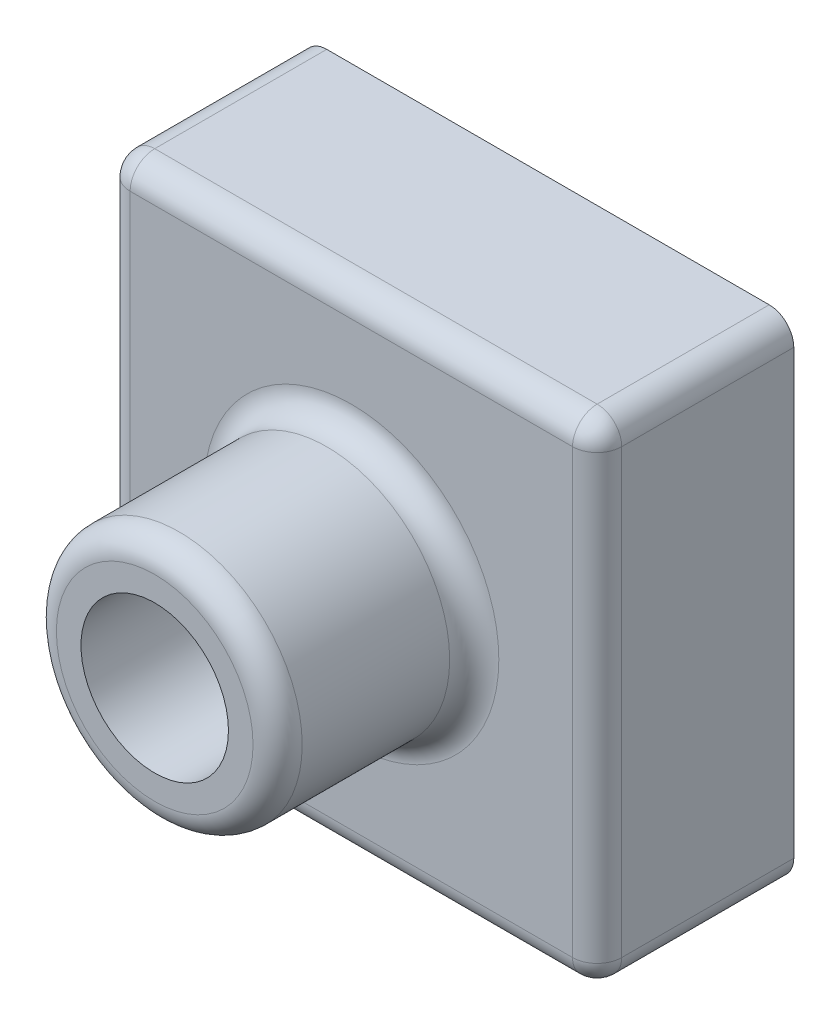
ISO-10303-21;
HEADER;
FILE_DESCRIPTION(('STEP AP214'),'2;1');
FILE_NAME('part.step','',(''),(''),'','','');
FILE_SCHEMA(('AUTOMOTIVE_DESIGN { 1 0 10303 214 1 1 1 1 }'));
ENDSEC;
DATA;
#1=APPLICATION_CONTEXT('core data for automotive mechanical design processes');
#2=APPLICATION_PROTOCOL_DEFINITION('international standard','automotive_design',2000,#1);
#3=PRODUCT_CONTEXT('',#1,'mechanical');
#4=PRODUCT('Part','Part','',(#3));
#5=PRODUCT_RELATED_PRODUCT_CATEGORY('part','',(#4));
#6=PRODUCT_DEFINITION_FORMATION('','',#4);
#7=PRODUCT_DEFINITION_CONTEXT('part definition',#1,'design');
#8=PRODUCT_DEFINITION('design','',#6,#7);
#9=PRODUCT_DEFINITION_SHAPE('','',#8);
#10=(LENGTH_UNIT() NAMED_UNIT(*) SI_UNIT(.MILLI.,.METRE.));
#11=(NAMED_UNIT(*) PLANE_ANGLE_UNIT() SI_UNIT($,.RADIAN.));
#12=(NAMED_UNIT(*) SI_UNIT($,.STERADIAN.) SOLID_ANGLE_UNIT());
#13=UNCERTAINTY_MEASURE_WITH_UNIT(LENGTH_MEASURE(1.E-05),#10,'distance_accuracy_value','');
#14=(GEOMETRIC_REPRESENTATION_CONTEXT(3) GLOBAL_UNCERTAINTY_ASSIGNED_CONTEXT((#13)) GLOBAL_UNIT_ASSIGNED_CONTEXT((#10,
#11,#12)) REPRESENTATION_CONTEXT('',''));
#15=CARTESIAN_POINT('',(0.,0.,0.));
#16=DIRECTION('',(0.,0.,1.));
#17=DIRECTION('',(1.,0.,0.));
#18=AXIS2_PLACEMENT_3D('',#15,#16,#17);
#19=CARTESIAN_POINT('',(0.,0.,40.));
#20=DIRECTION('',(0.,0.,-1.));
#21=DIRECTION('',(-1.,0.,0.));
#22=AXIS2_PLACEMENT_3D('',#19,#20,#21);
#23=PLANE('',#22);
#24=CARTESIAN_POINT('',(0.,0.,40.));
#25=DIRECTION('',(0.,0.,-1.));
#26=DIRECTION('',(-1.,0.,0.));
#27=AXIS2_PLACEMENT_3D('',#24,#25,#26);
#28=CIRCLE('',#27,30.);
#29=CARTESIAN_POINT('',(-30.,0.,40.));
#30=VERTEX_POINT('',#29);
#31=EDGE_CURVE('E145',#30,#30,#28,.T.);
#32=ORIENTED_EDGE('',*,*,#31,.T.);
#33=EDGE_LOOP('',(#32));
#34=FACE_BOUND('',#33,.T.);
#35=DIRECTION('',(0.,-1.,0.));
#36=VECTOR('',#35,1.);
#37=CARTESIAN_POINT('',(-45.,0.,40.));
#38=LINE('',#37,#36);
#39=CARTESIAN_POINT('',(-45.,45.,40.));
#40=VERTEX_POINT('',#39);
#41=CARTESIAN_POINT('',(-45.,-45.,40.));
#42=VERTEX_POINT('',#41);
#43=EDGE_CURVE('E143',#40,#42,#38,.T.);
#44=ORIENTED_EDGE('',*,*,#43,.T.);
#45=DIRECTION('',(1.,0.,0.));
#46=VECTOR('',#45,1.);
#47=CARTESIAN_POINT('',(0.,-45.,40.));
#48=LINE('',#47,#46);
#49=CARTESIAN_POINT('',(45.,-45.,40.));
#50=VERTEX_POINT('',#49);
#51=EDGE_CURVE('E116',#42,#50,#48,.T.);
#52=ORIENTED_EDGE('',*,*,#51,.T.);
#53=DIRECTION('',(0.,1.,0.));
#54=VECTOR('',#53,1.);
#55=CARTESIAN_POINT('',(45.,0.,40.));
#56=LINE('',#55,#54);
#57=CARTESIAN_POINT('',(45.,45.,40.));
#58=VERTEX_POINT('',#57);
#59=EDGE_CURVE('E133',#50,#58,#56,.T.);
#60=ORIENTED_EDGE('',*,*,#59,.T.);
#61=DIRECTION('',(-1.,0.,0.));
#62=VECTOR('',#61,1.);
#63=CARTESIAN_POINT('',(0.,45.,40.));
#64=LINE('',#63,#62);
#65=EDGE_CURVE('E139',#58,#40,#64,.T.);
#66=ORIENTED_EDGE('',*,*,#65,.T.);
#67=EDGE_LOOP('',(#44,#52,#60,#66));
#68=FACE_BOUND('',#67,.T.);
#69=ADVANCED_FACE('F33',(#34,#68),#23,.F.);
#70=CARTESIAN_POINT('',(50.,-50.,40.));
#71=DIRECTION('',(-1.,0.,0.));
#72=DIRECTION('',(0.,0.,1.));
#73=AXIS2_PLACEMENT_3D('',#70,#71,#72);
#74=PLANE('',#73);
#75=DIRECTION('',(0.,1.,0.));
#76=VECTOR('',#75,1.);
#77=CARTESIAN_POINT('',(50.,-50.,35.));
#78=LINE('',#77,#76);
#79=CARTESIAN_POINT('',(50.,45.,35.));
#80=VERTEX_POINT('',#79);
#81=CARTESIAN_POINT('',(50.,-45.,35.));
#82=VERTEX_POINT('',#81);
#83=EDGE_CURVE('E50',#80,#82,#78,.F.);
#84=ORIENTED_EDGE('',*,*,#83,.T.);
#85=DIRECTION('',(0.,0.,-1.));
#86=VECTOR('',#85,1.);
#87=CARTESIAN_POINT('',(50.,-45.,40.));
#88=LINE('',#87,#86);
#89=CARTESIAN_POINT('',(50.,-45.,0.));
#90=VERTEX_POINT('',#89);
#91=EDGE_CURVE('E171',#82,#90,#88,.T.);
#92=ORIENTED_EDGE('',*,*,#91,.T.);
#93=DIRECTION('',(0.,1.,0.));
#94=VECTOR('',#93,1.);
#95=CARTESIAN_POINT('',(50.,-50.,0.));
#96=LINE('',#95,#94);
#97=CARTESIAN_POINT('',(50.,45.,0.));
#98=VERTEX_POINT('',#97);
#99=EDGE_CURVE('E211',#90,#98,#96,.T.);
#100=ORIENTED_EDGE('',*,*,#99,.T.);
#101=DIRECTION('',(0.,0.,-1.));
#102=VECTOR('',#101,1.);
#103=CARTESIAN_POINT('',(50.,45.,40.));
#104=LINE('',#103,#102);
#105=EDGE_CURVE('E55',#98,#80,#104,.F.);
#106=ORIENTED_EDGE('',*,*,#105,.T.);
#107=EDGE_LOOP('',(#84,#92,#100,#106));
#108=FACE_BOUND('',#107,.T.);
#109=ADVANCED_FACE('F253',(#108),#74,.F.);
#110=CARTESIAN_POINT('',(-50.,50.,40.));
#111=DIRECTION('',(0.,-1.,0.));
#112=DIRECTION('',(0.,0.,-1.));
#113=AXIS2_PLACEMENT_3D('',#110,#111,#112);
#114=PLANE('',#113);
#115=DIRECTION('',(-1.,0.,0.));
#116=VECTOR('',#115,1.);
#117=CARTESIAN_POINT('',(-50.,50.,0.));
#118=LINE('',#117,#116);
#119=CARTESIAN_POINT('',(45.,50.,0.));
#120=VERTEX_POINT('',#119);
#121=CARTESIAN_POINT('',(-45.,50.,0.));
#122=VERTEX_POINT('',#121);
#123=EDGE_CURVE('E215',#120,#122,#118,.T.);
#124=ORIENTED_EDGE('',*,*,#123,.T.);
#125=DIRECTION('',(0.,0.,-1.));
#126=VECTOR('',#125,1.);
#127=CARTESIAN_POINT('',(-45.,50.,40.));
#128=LINE('',#127,#126);
#129=CARTESIAN_POINT('',(-45.,50.,35.));
#130=VERTEX_POINT('',#129);
#131=EDGE_CURVE('E167',#122,#130,#128,.F.);
#132=ORIENTED_EDGE('',*,*,#131,.T.);
#133=DIRECTION('',(-1.,0.,0.));
#134=VECTOR('',#133,1.);
#135=CARTESIAN_POINT('',(-50.,50.,35.));
#136=LINE('',#135,#134);
#137=CARTESIAN_POINT('',(45.,50.,35.));
#138=VERTEX_POINT('',#137);
#139=EDGE_CURVE('E165',#130,#138,#136,.F.);
#140=ORIENTED_EDGE('',*,*,#139,.T.);
#141=DIRECTION('',(0.,0.,-1.));
#142=VECTOR('',#141,1.);
#143=CARTESIAN_POINT('',(45.,50.,40.));
#144=LINE('',#143,#142);
#145=EDGE_CURVE('E163',#138,#120,#144,.T.);
#146=ORIENTED_EDGE('',*,*,#145,.T.);
#147=EDGE_LOOP('',(#124,#132,#140,#146));
#148=FACE_BOUND('',#147,.T.);
#149=ADVANCED_FACE('F277',(#148),#114,.F.);
#150=CARTESIAN_POINT('',(-50.,-50.,40.));
#151=DIRECTION('',(1.,0.,0.));
#152=DIRECTION('',(0.,0.,-1.));
#153=AXIS2_PLACEMENT_3D('',#150,#151,#152);
#154=PLANE('',#153);
#155=DIRECTION('',(0.,-1.,0.));
#156=VECTOR('',#155,1.);
#157=CARTESIAN_POINT('',(-50.,-50.,0.));
#158=LINE('',#157,#156);
#159=CARTESIAN_POINT('',(-50.,45.,0.));
#160=VERTEX_POINT('',#159);
#161=CARTESIAN_POINT('',(-50.,-45.,0.));
#162=VERTEX_POINT('',#161);
#163=EDGE_CURVE('E218',#160,#162,#158,.T.);
#164=ORIENTED_EDGE('',*,*,#163,.T.);
#165=DIRECTION('',(0.,0.,-1.));
#166=VECTOR('',#165,1.);
#167=CARTESIAN_POINT('',(-50.,-45.,40.));
#168=LINE('',#167,#166);
#169=CARTESIAN_POINT('',(-50.,-45.,35.));
#170=VERTEX_POINT('',#169);
#171=EDGE_CURVE('E161',#162,#170,#168,.F.);
#172=ORIENTED_EDGE('',*,*,#171,.T.);
#173=DIRECTION('',(0.,-1.,0.));
#174=VECTOR('',#173,1.);
#175=CARTESIAN_POINT('',(-50.,-50.,35.));
#176=LINE('',#175,#174);
#177=CARTESIAN_POINT('',(-50.,45.,35.));
#178=VERTEX_POINT('',#177);
#179=EDGE_CURVE('E159',#170,#178,#176,.F.);
#180=ORIENTED_EDGE('',*,*,#179,.T.);
#181=DIRECTION('',(0.,0.,-1.));
#182=VECTOR('',#181,1.);
#183=CARTESIAN_POINT('',(-50.,45.,40.));
#184=LINE('',#183,#182);
#185=EDGE_CURVE('E157',#178,#160,#184,.T.);
#186=ORIENTED_EDGE('',*,*,#185,.T.);
#187=EDGE_LOOP('',(#164,#172,#180,#186));
#188=FACE_BOUND('',#187,.T.);
#189=ADVANCED_FACE('F288',(#188),#154,.F.);
#190=CARTESIAN_POINT('',(-50.,-50.,40.));
#191=DIRECTION('',(0.,1.,0.));
#192=DIRECTION('',(0.,0.,1.));
#193=AXIS2_PLACEMENT_3D('',#190,#191,#192);
#194=PLANE('',#193);
#195=DIRECTION('',(1.,0.,0.));
#196=VECTOR('',#195,1.);
#197=CARTESIAN_POINT('',(-50.,-50.,35.));
#198=LINE('',#197,#196);
#199=CARTESIAN_POINT('',(45.,-50.,35.));
#200=VERTEX_POINT('',#199);
#201=CARTESIAN_POINT('',(-45.,-50.,35.));
#202=VERTEX_POINT('',#201);
#203=EDGE_CURVE('E118',#200,#202,#198,.F.);
#204=ORIENTED_EDGE('',*,*,#203,.T.);
#205=DIRECTION('',(0.,0.,-1.));
#206=VECTOR('',#205,1.);
#207=CARTESIAN_POINT('',(-45.,-50.,40.));
#208=LINE('',#207,#206);
#209=CARTESIAN_POINT('',(-45.,-50.,0.));
#210=VERTEX_POINT('',#209);
#211=EDGE_CURVE('E155',#202,#210,#208,.T.);
#212=ORIENTED_EDGE('',*,*,#211,.T.);
#213=DIRECTION('',(1.,0.,0.));
#214=VECTOR('',#213,1.);
#215=CARTESIAN_POINT('',(-50.,-50.,0.));
#216=LINE('',#215,#214);
#217=CARTESIAN_POINT('',(45.,-50.,0.));
#218=VERTEX_POINT('',#217);
#219=EDGE_CURVE('E221',#210,#218,#216,.T.);
#220=ORIENTED_EDGE('',*,*,#219,.T.);
#221=DIRECTION('',(0.,0.,-1.));
#222=VECTOR('',#221,1.);
#223=CARTESIAN_POINT('',(45.,-50.,40.));
#224=LINE('',#223,#222);
#225=EDGE_CURVE('E148',#218,#200,#224,.F.);
#226=ORIENTED_EDGE('',*,*,#225,.T.);
#227=EDGE_LOOP('',(#204,#212,#220,#226));
#228=FACE_BOUND('',#227,.T.);
#229=ADVANCED_FACE('F247',(#228),#194,.F.);
#230=CARTESIAN_POINT('',(0.,0.,0.));
#231=DIRECTION('',(0.,0.,-1.));
#232=DIRECTION('',(-1.,0.,0.));
#233=AXIS2_PLACEMENT_3D('',#230,#231,#232);
#234=PLANE('',#233);
#235=CARTESIAN_POINT('',(0.,0.,0.));
#236=DIRECTION('',(0.,0.,1.));
#237=DIRECTION('',(1.,0.,0.));
#238=AXIS2_PLACEMENT_3D('',#235,#236,#237);
#239=CIRCLE('',#238,15.);
#240=CARTESIAN_POINT('',(15.,0.,0.));
#241=VERTEX_POINT('',#240);
#242=EDGE_CURVE('E206',#241,#241,#239,.T.);
#243=ORIENTED_EDGE('',*,*,#242,.T.);
#244=EDGE_LOOP('',(#243));
#245=FACE_BOUND('',#244,.T.);
#246=ORIENTED_EDGE('',*,*,#219,.F.);
#247=CARTESIAN_POINT('',(-45.,-45.,0.));
#248=DIRECTION('',(0.,0.,-1.));
#249=DIRECTION('',(-1.,0.,0.));
#250=AXIS2_PLACEMENT_3D('',#247,#248,#249);
#251=CIRCLE('',#250,5.);
#252=EDGE_CURVE('E11',#210,#162,#251,.T.);
#253=ORIENTED_EDGE('',*,*,#252,.T.);
#254=ORIENTED_EDGE('',*,*,#163,.F.);
#255=CARTESIAN_POINT('',(-45.,45.,0.));
#256=DIRECTION('',(0.,0.,-1.));
#257=DIRECTION('',(-1.,0.,0.));
#258=AXIS2_PLACEMENT_3D('',#255,#256,#257);
#259=CIRCLE('',#258,5.);
#260=EDGE_CURVE('E42',#160,#122,#259,.T.);
#261=ORIENTED_EDGE('',*,*,#260,.T.);
#262=ORIENTED_EDGE('',*,*,#123,.F.);
#263=CARTESIAN_POINT('',(45.,45.,0.));
#264=DIRECTION('',(0.,0.,-1.));
#265=DIRECTION('',(-1.,0.,0.));
#266=AXIS2_PLACEMENT_3D('',#263,#264,#265);
#267=CIRCLE('',#266,5.);
#268=EDGE_CURVE('E176',#120,#98,#267,.T.);
#269=ORIENTED_EDGE('',*,*,#268,.T.);
#270=ORIENTED_EDGE('',*,*,#99,.F.);
#271=CARTESIAN_POINT('',(45.,-45.,0.));
#272=DIRECTION('',(0.,0.,-1.));
#273=DIRECTION('',(-1.,0.,0.));
#274=AXIS2_PLACEMENT_3D('',#271,#272,#273);
#275=CIRCLE('',#274,5.);
#276=EDGE_CURVE('E178',#90,#218,#275,.T.);
#277=ORIENTED_EDGE('',*,*,#276,.T.);
#278=EDGE_LOOP('',(#246,#253,#254,#261,#262,#269,#270,#277));
#279=FACE_BOUND('',#278,.T.);
#280=ADVANCED_FACE('F255',(#245,#279),#234,.T.);
#281=CARTESIAN_POINT('',(0.,0.,80.));
#282=DIRECTION('',(0.,0.,-1.));
#283=DIRECTION('',(-1.,0.,0.));
#284=AXIS2_PLACEMENT_3D('',#281,#282,#283);
#285=CYLINDRICAL_SURFACE('',#284,25.);
#286=CARTESIAN_POINT('',(0.,0.,45.));
#287=DIRECTION('',(0.,0.,-1.));
#288=DIRECTION('',(-1.,0.,0.));
#289=AXIS2_PLACEMENT_3D('',#286,#287,#288);
#290=CIRCLE('',#289,25.);
#291=CARTESIAN_POINT('',(-25.,0.,45.));
#292=VERTEX_POINT('',#291);
#293=EDGE_CURVE('E140',#292,#292,#290,.F.);
#294=ORIENTED_EDGE('',*,*,#293,.T.);
#295=EDGE_LOOP('',(#294));
#296=FACE_BOUND('',#295,.T.);
#297=CARTESIAN_POINT('',(0.,0.,75.));
#298=DIRECTION('',(0.,0.,1.));
#299=DIRECTION('',(1.,0.,0.));
#300=AXIS2_PLACEMENT_3D('',#297,#298,#299);
#301=CIRCLE('',#300,25.);
#302=CARTESIAN_POINT('',(25.,0.,75.));
#303=VERTEX_POINT('',#302);
#304=EDGE_CURVE('E224',#303,#303,#301,.F.);
#305=ORIENTED_EDGE('',*,*,#304,.T.);
#306=EDGE_LOOP('',(#305));
#307=FACE_BOUND('',#306,.T.);
#308=ADVANCED_FACE('F281',(#296,#307),#285,.T.);
#309=CARTESIAN_POINT('',(0.,0.,80.));
#310=DIRECTION('',(0.,0.,1.));
#311=DIRECTION('',(1.,0.,0.));
#312=AXIS2_PLACEMENT_3D('',#309,#310,#311);
#313=PLANE('',#312);
#314=CARTESIAN_POINT('',(0.,0.,80.));
#315=DIRECTION('',(0.,0.,1.));
#316=DIRECTION('',(1.,0.,0.));
#317=AXIS2_PLACEMENT_3D('',#314,#315,#316);
#318=CIRCLE('',#317,20.);
#319=CARTESIAN_POINT('',(20.,0.,80.));
#320=VERTEX_POINT('',#319);
#321=EDGE_CURVE('E173',#320,#320,#318,.T.);
#322=ORIENTED_EDGE('',*,*,#321,.T.);
#323=EDGE_LOOP('',(#322));
#324=FACE_BOUND('',#323,.T.);
#325=CARTESIAN_POINT('',(0.,0.,80.));
#326=DIRECTION('',(0.,0.,1.));
#327=DIRECTION('',(1.,0.,0.));
#328=AXIS2_PLACEMENT_3D('',#325,#326,#327);
#329=CIRCLE('',#328,15.);
#330=CARTESIAN_POINT('',(15.,0.,80.));
#331=VERTEX_POINT('',#330);
#332=EDGE_CURVE('E203',#331,#331,#329,.T.);
#333=ORIENTED_EDGE('',*,*,#332,.F.);
#334=EDGE_LOOP('',(#333));
#335=FACE_BOUND('',#334,.T.);
#336=ADVANCED_FACE('F404',(#324,#335),#313,.T.);
#337=CARTESIAN_POINT('',(0.,0.,0.));
#338=DIRECTION('',(0.,0.,1.));
#339=DIRECTION('',(1.,0.,0.));
#340=AXIS2_PLACEMENT_3D('',#337,#338,#339);
#341=CYLINDRICAL_SURFACE('',#340,15.);
#342=ORIENTED_EDGE('',*,*,#242,.F.);
#343=EDGE_LOOP('',(#342));
#344=FACE_BOUND('',#343,.T.);
#345=ORIENTED_EDGE('',*,*,#332,.T.);
#346=EDGE_LOOP('',(#345));
#347=FACE_BOUND('',#346,.T.);
#348=ADVANCED_FACE('F299',(#344,#347),#341,.F.);
#349=CARTESIAN_POINT('',(0.,0.,45.));
#350=DIRECTION('',(0.,0.,-1.));
#351=DIRECTION('',(-1.,0.,0.));
#352=AXIS2_PLACEMENT_3D('',#349,#350,#351);
#353=TOROIDAL_SURFACE('',#352,30.,5.);
#354=ORIENTED_EDGE('',*,*,#31,.F.);
#355=EDGE_LOOP('',(#354));
#356=FACE_BOUND('',#355,.T.);
#357=ORIENTED_EDGE('',*,*,#293,.F.);
#358=EDGE_LOOP('',(#357));
#359=FACE_BOUND('',#358,.T.);
#360=ADVANCED_FACE('F295',(#356,#359),#353,.F.);
#361=CARTESIAN_POINT('',(-45.,45.,40.));
#362=DIRECTION('',(0.,0.,-1.));
#363=DIRECTION('',(-1.,0.,0.));
#364=AXIS2_PLACEMENT_3D('',#361,#362,#363);
#365=CYLINDRICAL_SURFACE('',#364,5.);
#366=ORIENTED_EDGE('',*,*,#260,.F.);
#367=ORIENTED_EDGE('',*,*,#185,.F.);
#368=CARTESIAN_POINT('',(-45.,45.,35.));
#369=DIRECTION('',(0.,0.,1.));
#370=DIRECTION('',(1.,0.,0.));
#371=AXIS2_PLACEMENT_3D('',#368,#369,#370);
#372=CIRCLE('',#371,5.);
#373=EDGE_CURVE('E37',#130,#178,#372,.T.);
#374=ORIENTED_EDGE('',*,*,#373,.F.);
#375=ORIENTED_EDGE('',*,*,#131,.F.);
#376=EDGE_LOOP('',(#366,#367,#374,#375));
#377=FACE_BOUND('',#376,.T.);
#378=ADVANCED_FACE('F298',(#377),#365,.T.);
#379=CARTESIAN_POINT('',(0.,45.,35.));
#380=DIRECTION('',(-1.,0.,0.));
#381=DIRECTION('',(0.,0.,1.));
#382=AXIS2_PLACEMENT_3D('',#379,#380,#381);
#383=CYLINDRICAL_SURFACE('',#382,5.);
#384=CARTESIAN_POINT('',(45.,45.,35.));
#385=DIRECTION('',(1.,0.,0.));
#386=DIRECTION('',(0.,0.,-1.));
#387=AXIS2_PLACEMENT_3D('',#384,#385,#386);
#388=CIRCLE('',#387,5.);
#389=EDGE_CURVE('E195',#138,#58,#388,.T.);
#390=ORIENTED_EDGE('',*,*,#389,.F.);
#391=ORIENTED_EDGE('',*,*,#139,.F.);
#392=CARTESIAN_POINT('',(-45.,45.,35.));
#393=DIRECTION('',(-1.,0.,0.));
#394=DIRECTION('',(0.,0.,1.));
#395=AXIS2_PLACEMENT_3D('',#392,#393,#394);
#396=CIRCLE('',#395,5.);
#397=EDGE_CURVE('E197',#40,#130,#396,.T.);
#398=ORIENTED_EDGE('',*,*,#397,.F.);
#399=ORIENTED_EDGE('',*,*,#65,.F.);
#400=EDGE_LOOP('',(#390,#391,#398,#399));
#401=FACE_BOUND('',#400,.T.);
#402=ADVANCED_FACE('F231',(#401),#383,.T.);
#403=CARTESIAN_POINT('',(45.,45.,40.));
#404=DIRECTION('',(0.,0.,-1.));
#405=DIRECTION('',(-1.,0.,0.));
#406=AXIS2_PLACEMENT_3D('',#403,#404,#405);
#407=CYLINDRICAL_SURFACE('',#406,5.);
#408=ORIENTED_EDGE('',*,*,#268,.F.);
#409=ORIENTED_EDGE('',*,*,#145,.F.);
#410=CARTESIAN_POINT('',(45.,45.,35.));
#411=DIRECTION('',(0.,0.,1.));
#412=DIRECTION('',(1.,0.,0.));
#413=AXIS2_PLACEMENT_3D('',#410,#411,#412);
#414=CIRCLE('',#413,5.);
#415=EDGE_CURVE('E192',#80,#138,#414,.T.);
#416=ORIENTED_EDGE('',*,*,#415,.F.);
#417=ORIENTED_EDGE('',*,*,#105,.F.);
#418=EDGE_LOOP('',(#408,#409,#416,#417));
#419=FACE_BOUND('',#418,.T.);
#420=ADVANCED_FACE('F260',(#419),#407,.T.);
#421=CARTESIAN_POINT('',(-45.,45.,35.));
#422=DIRECTION('',(0.,0.,1.));
#423=DIRECTION('',(1.,0.,0.));
#424=AXIS2_PLACEMENT_3D('',#421,#422,#423);
#425=SPHERICAL_SURFACE('',#424,5.);
#426=ORIENTED_EDGE('',*,*,#397,.T.);
#427=ORIENTED_EDGE('',*,*,#373,.T.);
#428=CARTESIAN_POINT('',(-45.,45.,35.));
#429=DIRECTION('',(0.,1.,0.));
#430=DIRECTION('',(0.,0.,1.));
#431=AXIS2_PLACEMENT_3D('',#428,#429,#430);
#432=CIRCLE('',#431,5.);
#433=EDGE_CURVE('E189',#40,#178,#432,.F.);
#434=ORIENTED_EDGE('',*,*,#433,.F.);
#435=EDGE_LOOP('',(#426,#427,#434));
#436=FACE_BOUND('',#435,.T.);
#437=ADVANCED_FACE('F232',(#436),#425,.T.);
#438=CARTESIAN_POINT('',(45.,45.,35.));
#439=DIRECTION('',(0.,0.,1.));
#440=DIRECTION('',(1.,0.,0.));
#441=AXIS2_PLACEMENT_3D('',#438,#439,#440);
#442=SPHERICAL_SURFACE('',#441,5.);
#443=ORIENTED_EDGE('',*,*,#415,.T.);
#444=ORIENTED_EDGE('',*,*,#389,.T.);
#445=CARTESIAN_POINT('',(45.,45.,35.));
#446=DIRECTION('',(0.,1.,0.));
#447=DIRECTION('',(0.,0.,1.));
#448=AXIS2_PLACEMENT_3D('',#445,#446,#447);
#449=CIRCLE('',#448,5.);
#450=EDGE_CURVE('E136',#80,#58,#449,.F.);
#451=ORIENTED_EDGE('',*,*,#450,.F.);
#452=EDGE_LOOP('',(#443,#444,#451));
#453=FACE_BOUND('',#452,.T.);
#454=ADVANCED_FACE('F262',(#453),#442,.T.);
#455=CARTESIAN_POINT('',(-45.,-45.,40.));
#456=DIRECTION('',(0.,0.,-1.));
#457=DIRECTION('',(-1.,0.,0.));
#458=AXIS2_PLACEMENT_3D('',#455,#456,#457);
#459=CYLINDRICAL_SURFACE('',#458,5.);
#460=ORIENTED_EDGE('',*,*,#252,.F.);
#461=ORIENTED_EDGE('',*,*,#211,.F.);
#462=CARTESIAN_POINT('',(-45.,-45.,35.));
#463=DIRECTION('',(0.,0.,1.));
#464=DIRECTION('',(1.,0.,0.));
#465=AXIS2_PLACEMENT_3D('',#462,#463,#464);
#466=CIRCLE('',#465,5.);
#467=EDGE_CURVE('E185',#170,#202,#466,.T.);
#468=ORIENTED_EDGE('',*,*,#467,.F.);
#469=ORIENTED_EDGE('',*,*,#171,.F.);
#470=EDGE_LOOP('',(#460,#461,#468,#469));
#471=FACE_BOUND('',#470,.T.);
#472=ADVANCED_FACE('F244',(#471),#459,.T.);
#473=CARTESIAN_POINT('',(-45.,0.,35.));
#474=DIRECTION('',(0.,-1.,0.));
#475=DIRECTION('',(0.,0.,-1.));
#476=AXIS2_PLACEMENT_3D('',#473,#474,#475);
#477=CYLINDRICAL_SURFACE('',#476,5.);
#478=ORIENTED_EDGE('',*,*,#433,.T.);
#479=ORIENTED_EDGE('',*,*,#179,.F.);
#480=CARTESIAN_POINT('',(-45.,-45.,35.));
#481=DIRECTION('',(0.,-1.,0.));
#482=DIRECTION('',(0.,0.,-1.));
#483=AXIS2_PLACEMENT_3D('',#480,#481,#482);
#484=CIRCLE('',#483,5.);
#485=EDGE_CURVE('E130',#42,#170,#484,.T.);
#486=ORIENTED_EDGE('',*,*,#485,.F.);
#487=ORIENTED_EDGE('',*,*,#43,.F.);
#488=EDGE_LOOP('',(#478,#479,#486,#487));
#489=FACE_BOUND('',#488,.T.);
#490=ADVANCED_FACE('F235',(#489),#477,.T.);
#491=CARTESIAN_POINT('',(45.,0.,35.));
#492=DIRECTION('',(0.,1.,0.));
#493=DIRECTION('',(0.,0.,1.));
#494=AXIS2_PLACEMENT_3D('',#491,#492,#493);
#495=CYLINDRICAL_SURFACE('',#494,5.);
#496=ORIENTED_EDGE('',*,*,#450,.T.);
#497=ORIENTED_EDGE('',*,*,#59,.F.);
#498=CARTESIAN_POINT('',(45.,-45.,35.));
#499=DIRECTION('',(0.,-1.,0.));
#500=DIRECTION('',(0.,0.,-1.));
#501=AXIS2_PLACEMENT_3D('',#498,#499,#500);
#502=CIRCLE('',#501,5.);
#503=EDGE_CURVE('E124',#82,#50,#502,.T.);
#504=ORIENTED_EDGE('',*,*,#503,.F.);
#505=ORIENTED_EDGE('',*,*,#83,.F.);
#506=EDGE_LOOP('',(#496,#497,#504,#505));
#507=FACE_BOUND('',#506,.T.);
#508=ADVANCED_FACE('F134',(#507),#495,.T.);
#509=CARTESIAN_POINT('',(45.,-45.,40.));
#510=DIRECTION('',(0.,0.,-1.));
#511=DIRECTION('',(-1.,0.,0.));
#512=AXIS2_PLACEMENT_3D('',#509,#510,#511);
#513=CYLINDRICAL_SURFACE('',#512,5.);
#514=ORIENTED_EDGE('',*,*,#276,.F.);
#515=ORIENTED_EDGE('',*,*,#91,.F.);
#516=CARTESIAN_POINT('',(45.,-45.,35.));
#517=DIRECTION('',(0.,0.,1.));
#518=DIRECTION('',(1.,0.,0.));
#519=AXIS2_PLACEMENT_3D('',#516,#517,#518);
#520=CIRCLE('',#519,5.);
#521=EDGE_CURVE('E128',#200,#82,#520,.T.);
#522=ORIENTED_EDGE('',*,*,#521,.F.);
#523=ORIENTED_EDGE('',*,*,#225,.F.);
#524=EDGE_LOOP('',(#514,#515,#522,#523));
#525=FACE_BOUND('',#524,.T.);
#526=ADVANCED_FACE('F251',(#525),#513,.T.);
#527=CARTESIAN_POINT('',(-45.,-45.,35.));
#528=DIRECTION('',(0.,0.,1.));
#529=DIRECTION('',(1.,0.,0.));
#530=AXIS2_PLACEMENT_3D('',#527,#528,#529);
#531=SPHERICAL_SURFACE('',#530,5.);
#532=ORIENTED_EDGE('',*,*,#485,.T.);
#533=ORIENTED_EDGE('',*,*,#467,.T.);
#534=CARTESIAN_POINT('',(-45.,-45.,35.));
#535=DIRECTION('',(-1.,0.,0.));
#536=DIRECTION('',(0.,0.,1.));
#537=AXIS2_PLACEMENT_3D('',#534,#535,#536);
#538=CIRCLE('',#537,5.);
#539=EDGE_CURVE('E121',#42,#202,#538,.F.);
#540=ORIENTED_EDGE('',*,*,#539,.F.);
#541=EDGE_LOOP('',(#532,#533,#540));
#542=FACE_BOUND('',#541,.T.);
#543=ADVANCED_FACE('F239',(#542),#531,.T.);
#544=CARTESIAN_POINT('',(45.,-45.,35.));
#545=DIRECTION('',(0.,0.,1.));
#546=DIRECTION('',(1.,0.,0.));
#547=AXIS2_PLACEMENT_3D('',#544,#545,#546);
#548=SPHERICAL_SURFACE('',#547,5.);
#549=ORIENTED_EDGE('',*,*,#521,.T.);
#550=ORIENTED_EDGE('',*,*,#503,.T.);
#551=CARTESIAN_POINT('',(45.,-45.,35.));
#552=DIRECTION('',(1.,0.,0.));
#553=DIRECTION('',(0.,0.,-1.));
#554=AXIS2_PLACEMENT_3D('',#551,#552,#553);
#555=CIRCLE('',#554,5.);
#556=EDGE_CURVE('E112',#200,#50,#555,.F.);
#557=ORIENTED_EDGE('',*,*,#556,.F.);
#558=EDGE_LOOP('',(#549,#550,#557));
#559=FACE_BOUND('',#558,.T.);
#560=ADVANCED_FACE('F126',(#559),#548,.T.);
#561=CARTESIAN_POINT('',(0.,-45.,35.));
#562=DIRECTION('',(1.,0.,0.));
#563=DIRECTION('',(0.,0.,-1.));
#564=AXIS2_PLACEMENT_3D('',#561,#562,#563);
#565=CYLINDRICAL_SURFACE('',#564,5.);
#566=ORIENTED_EDGE('',*,*,#539,.T.);
#567=ORIENTED_EDGE('',*,*,#203,.F.);
#568=ORIENTED_EDGE('',*,*,#556,.T.);
#569=ORIENTED_EDGE('',*,*,#51,.F.);
#570=EDGE_LOOP('',(#566,#567,#568,#569));
#571=FACE_BOUND('',#570,.T.);
#572=ADVANCED_FACE('F114',(#571),#565,.T.);
#573=CARTESIAN_POINT('',(0.,0.,75.));
#574=DIRECTION('',(0.,0.,1.));
#575=DIRECTION('',(1.,0.,0.));
#576=AXIS2_PLACEMENT_3D('',#573,#574,#575);
#577=TOROIDAL_SURFACE('',#576,20.,5.);
#578=ORIENTED_EDGE('',*,*,#304,.F.);
#579=EDGE_LOOP('',(#578));
#580=FACE_BOUND('',#579,.T.);
#581=ORIENTED_EDGE('',*,*,#321,.F.);
#582=EDGE_LOOP('',(#581));
#583=FACE_BOUND('',#582,.T.);
#584=ADVANCED_FACE('F35',(#580,#583),#577,.T.);
#585=CLOSED_SHELL('',(#69,#109,#149,#189,#229,#280,#308,#336,#348,#360,#378,#402,#420,#437,#454,
#472,#490,#508,#526,#543,#560,#572,#584));
#586=MANIFOLD_SOLID_BREP('B2',#585);
#587=ADVANCED_BREP_SHAPE_REPRESENTATION('',(#18,#586),#14);
#588=SHAPE_DEFINITION_REPRESENTATION(#9,#587);
ENDSEC;
END-ISO-10303-21;
